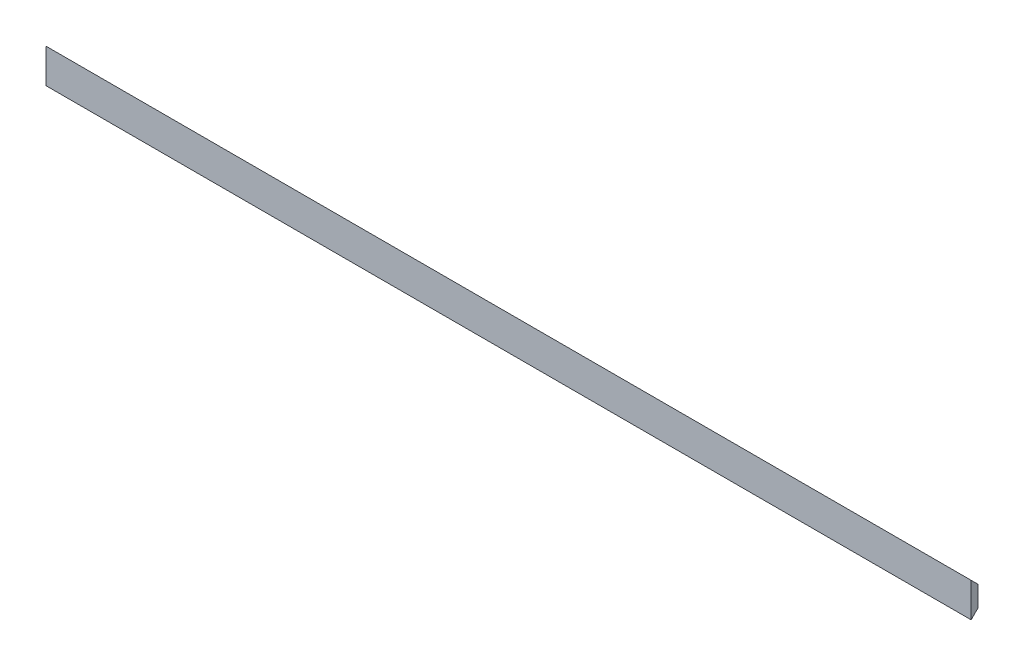
ISO-10303-21;
HEADER;
FILE_DESCRIPTION(('STEP AP214'),'2;1');
FILE_NAME('part.step','',(''),(''),'','','');
FILE_SCHEMA(('AUTOMOTIVE_DESIGN { 1 0 10303 214 1 1 1 1 }'));
ENDSEC;
DATA;
#1=APPLICATION_CONTEXT('core data for automotive mechanical design processes');
#2=APPLICATION_PROTOCOL_DEFINITION('international standard','automotive_design',2000,#1);
#3=PRODUCT_CONTEXT('',#1,'mechanical');
#4=PRODUCT('Part','Part','',(#3));
#5=PRODUCT_RELATED_PRODUCT_CATEGORY('part','',(#4));
#6=PRODUCT_DEFINITION_FORMATION('','',#4);
#7=PRODUCT_DEFINITION_CONTEXT('part definition',#1,'design');
#8=PRODUCT_DEFINITION('design','',#6,#7);
#9=PRODUCT_DEFINITION_SHAPE('','',#8);
#10=(LENGTH_UNIT() NAMED_UNIT(*) SI_UNIT(.MILLI.,.METRE.));
#11=(NAMED_UNIT(*) PLANE_ANGLE_UNIT() SI_UNIT($,.RADIAN.));
#12=(NAMED_UNIT(*) SI_UNIT($,.STERADIAN.) SOLID_ANGLE_UNIT());
#13=UNCERTAINTY_MEASURE_WITH_UNIT(LENGTH_MEASURE(1.E-05),#10,'distance_accuracy_value','');
#14=(GEOMETRIC_REPRESENTATION_CONTEXT(3) GLOBAL_UNCERTAINTY_ASSIGNED_CONTEXT((#13)) GLOBAL_UNIT_ASSIGNED_CONTEXT((#10,
#11,#12)) REPRESENTATION_CONTEXT('',''));
#15=CARTESIAN_POINT('',(0.,0.,0.));
#16=DIRECTION('',(0.,0.,1.));
#17=DIRECTION('',(1.,0.,0.));
#18=AXIS2_PLACEMENT_3D('',#15,#16,#17);
#19=CARTESIAN_POINT('',(0.,0.,20.));
#20=DIRECTION('',(1.,0.,0.));
#21=DIRECTION('',(0.,0.,-1.));
#22=AXIS2_PLACEMENT_3D('',#19,#20,#21);
#23=PLANE('',#22);
#24=DIRECTION('',(0.,-1.,0.));
#25=VECTOR('',#24,1.);
#26=CARTESIAN_POINT('',(0.,0.,0.));
#27=LINE('',#26,#25);
#28=CARTESIAN_POINT('',(0.,80.0000000000002,0.));
#29=VERTEX_POINT('',#28);
#30=CARTESIAN_POINT('',(0.,20.,0.));
#31=VERTEX_POINT('',#30);
#32=EDGE_CURVE('E83',#29,#31,#27,.T.);
#33=ORIENTED_EDGE('',*,*,#32,.T.);
#34=DIRECTION('',(0.,-0.707106781186548,0.707106781186547));
#35=VECTOR('',#34,1.);
#36=CARTESIAN_POINT('',(0.,0.,20.));
#37=LINE('',#36,#35);
#38=CARTESIAN_POINT('',(0.,0.,20.));
#39=VERTEX_POINT('',#38);
#40=EDGE_CURVE('E11',#31,#39,#37,.T.);
#41=ORIENTED_EDGE('',*,*,#40,.T.);
#42=DIRECTION('',(0.,-1.,0.));
#43=VECTOR('',#42,1.);
#44=CARTESIAN_POINT('',(0.,0.,20.));
#45=LINE('',#44,#43);
#46=CARTESIAN_POINT('',(0.,100.,20.));
#47=VERTEX_POINT('',#46);
#48=EDGE_CURVE('E82',#47,#39,#45,.T.);
#49=ORIENTED_EDGE('',*,*,#48,.F.);
#50=DIRECTION('',(0.,-0.707106781186544,-0.707106781186551));
#51=VECTOR('',#50,1.);
#52=CARTESIAN_POINT('',(0.,100.,20.));
#53=LINE('',#52,#51);
#54=EDGE_CURVE('E51',#47,#29,#53,.T.);
#55=ORIENTED_EDGE('',*,*,#54,.T.);
#56=EDGE_LOOP('',(#33,#41,#49,#55));
#57=FACE_BOUND('',#56,.T.);
#58=ADVANCED_FACE('F41',(#57),#23,.F.);
#59=CARTESIAN_POINT('',(2700.,0.,20.));
#60=DIRECTION('',(-1.,0.,0.));
#61=DIRECTION('',(0.,0.,1.));
#62=AXIS2_PLACEMENT_3D('',#59,#60,#61);
#63=PLANE('',#62);
#64=DIRECTION('',(0.,1.,0.));
#65=VECTOR('',#64,1.);
#66=CARTESIAN_POINT('',(2700.,0.,20.));
#67=LINE('',#66,#65);
#68=CARTESIAN_POINT('',(2700.,0.,20.));
#69=VERTEX_POINT('',#68);
#70=CARTESIAN_POINT('',(2700.,100.,20.));
#71=VERTEX_POINT('',#70);
#72=EDGE_CURVE('E101',#69,#71,#67,.T.);
#73=ORIENTED_EDGE('',*,*,#72,.F.);
#74=DIRECTION('',(0.,0.707106781186548,-0.707106781186547));
#75=VECTOR('',#74,1.);
#76=CARTESIAN_POINT('',(2700.,0.,20.));
#77=LINE('',#76,#75);
#78=CARTESIAN_POINT('',(2700.,20.,0.));
#79=VERTEX_POINT('',#78);
#80=EDGE_CURVE('E99',#69,#79,#77,.T.);
#81=ORIENTED_EDGE('',*,*,#80,.T.);
#82=DIRECTION('',(0.,1.,0.));
#83=VECTOR('',#82,1.);
#84=CARTESIAN_POINT('',(2700.,0.,0.));
#85=LINE('',#84,#83);
#86=CARTESIAN_POINT('',(2700.,80.0000000000002,0.));
#87=VERTEX_POINT('',#86);
#88=EDGE_CURVE('E96',#79,#87,#85,.T.);
#89=ORIENTED_EDGE('',*,*,#88,.T.);
#90=DIRECTION('',(0.,0.707106781186544,0.707106781186551));
#91=VECTOR('',#90,1.);
#92=CARTESIAN_POINT('',(2700.,100.,20.));
#93=LINE('',#92,#91);
#94=EDGE_CURVE('E108',#87,#71,#93,.T.);
#95=ORIENTED_EDGE('',*,*,#94,.T.);
#96=EDGE_LOOP('',(#73,#81,#89,#95));
#97=FACE_BOUND('',#96,.T.);
#98=ADVANCED_FACE('F128',(#97),#63,.F.);
#99=CARTESIAN_POINT('',(0.,0.,20.));
#100=DIRECTION('',(0.,0.,-1.));
#101=DIRECTION('',(-1.,0.,0.));
#102=AXIS2_PLACEMENT_3D('',#99,#100,#101);
#103=PLANE('',#102);
#104=ORIENTED_EDGE('',*,*,#48,.T.);
#105=DIRECTION('',(1.,0.,0.));
#106=VECTOR('',#105,1.);
#107=CARTESIAN_POINT('',(0.,0.,20.));
#108=LINE('',#107,#106);
#109=EDGE_CURVE('E91',#39,#69,#108,.T.);
#110=ORIENTED_EDGE('',*,*,#109,.T.);
#111=ORIENTED_EDGE('',*,*,#72,.T.);
#112=DIRECTION('',(-1.,0.,0.));
#113=VECTOR('',#112,1.);
#114=CARTESIAN_POINT('',(0.,100.,20.));
#115=LINE('',#114,#113);
#116=EDGE_CURVE('E94',#71,#47,#115,.T.);
#117=ORIENTED_EDGE('',*,*,#116,.T.);
#118=EDGE_LOOP('',(#104,#110,#111,#117));
#119=FACE_BOUND('',#118,.T.);
#120=ADVANCED_FACE('F89',(#119),#103,.F.);
#121=CARTESIAN_POINT('',(0.,0.,0.));
#122=DIRECTION('',(0.,0.,-1.));
#123=DIRECTION('',(-1.,0.,0.));
#124=AXIS2_PLACEMENT_3D('',#121,#122,#123);
#125=PLANE('',#124);
#126=ORIENTED_EDGE('',*,*,#88,.F.);
#127=DIRECTION('',(-1.,0.,0.));
#128=VECTOR('',#127,1.);
#129=CARTESIAN_POINT('',(0.,20.,0.));
#130=LINE('',#129,#128);
#131=EDGE_CURVE('E58',#79,#31,#130,.T.);
#132=ORIENTED_EDGE('',*,*,#131,.T.);
#133=ORIENTED_EDGE('',*,*,#32,.F.);
#134=DIRECTION('',(1.,0.,0.));
#135=VECTOR('',#134,1.);
#136=CARTESIAN_POINT('',(2700.,80.0000000000002,0.));
#137=LINE('',#136,#135);
#138=EDGE_CURVE('E118',#29,#87,#137,.T.);
#139=ORIENTED_EDGE('',*,*,#138,.T.);
#140=EDGE_LOOP('',(#126,#132,#133,#139));
#141=FACE_BOUND('',#140,.T.);
#142=ADVANCED_FACE('F124',(#141),#125,.T.);
#143=CARTESIAN_POINT('',(0.,0.,20.));
#144=DIRECTION('',(0.,-0.707106781186547,-0.707106781186548));
#145=DIRECTION('',(-1.,0.,0.));
#146=AXIS2_PLACEMENT_3D('',#143,#144,#145);
#147=PLANE('',#146);
#148=ORIENTED_EDGE('',*,*,#40,.F.);
#149=ORIENTED_EDGE('',*,*,#131,.F.);
#150=ORIENTED_EDGE('',*,*,#80,.F.);
#151=ORIENTED_EDGE('',*,*,#109,.F.);
#152=EDGE_LOOP('',(#148,#149,#150,#151));
#153=FACE_BOUND('',#152,.T.);
#154=ADVANCED_FACE('F98',(#153),#147,.T.);
#155=CARTESIAN_POINT('',(0.,100.,20.));
#156=DIRECTION('',(0.,0.707106781186551,-0.707106781186544));
#157=DIRECTION('',(1.,0.,0.));
#158=AXIS2_PLACEMENT_3D('',#155,#156,#157);
#159=PLANE('',#158);
#160=ORIENTED_EDGE('',*,*,#94,.F.);
#161=ORIENTED_EDGE('',*,*,#138,.F.);
#162=ORIENTED_EDGE('',*,*,#54,.F.);
#163=ORIENTED_EDGE('',*,*,#116,.F.);
#164=EDGE_LOOP('',(#160,#161,#162,#163));
#165=FACE_BOUND('',#164,.T.);
#166=ADVANCED_FACE('F44',(#165),#159,.T.);
#167=CLOSED_SHELL('',(#58,#98,#120,#142,#154,#166));
#168=MANIFOLD_SOLID_BREP('B2',#167);
#169=ADVANCED_BREP_SHAPE_REPRESENTATION('',(#18,#168),#14);
#170=SHAPE_DEFINITION_REPRESENTATION(#9,#169);
ENDSEC;
END-ISO-10303-21;
